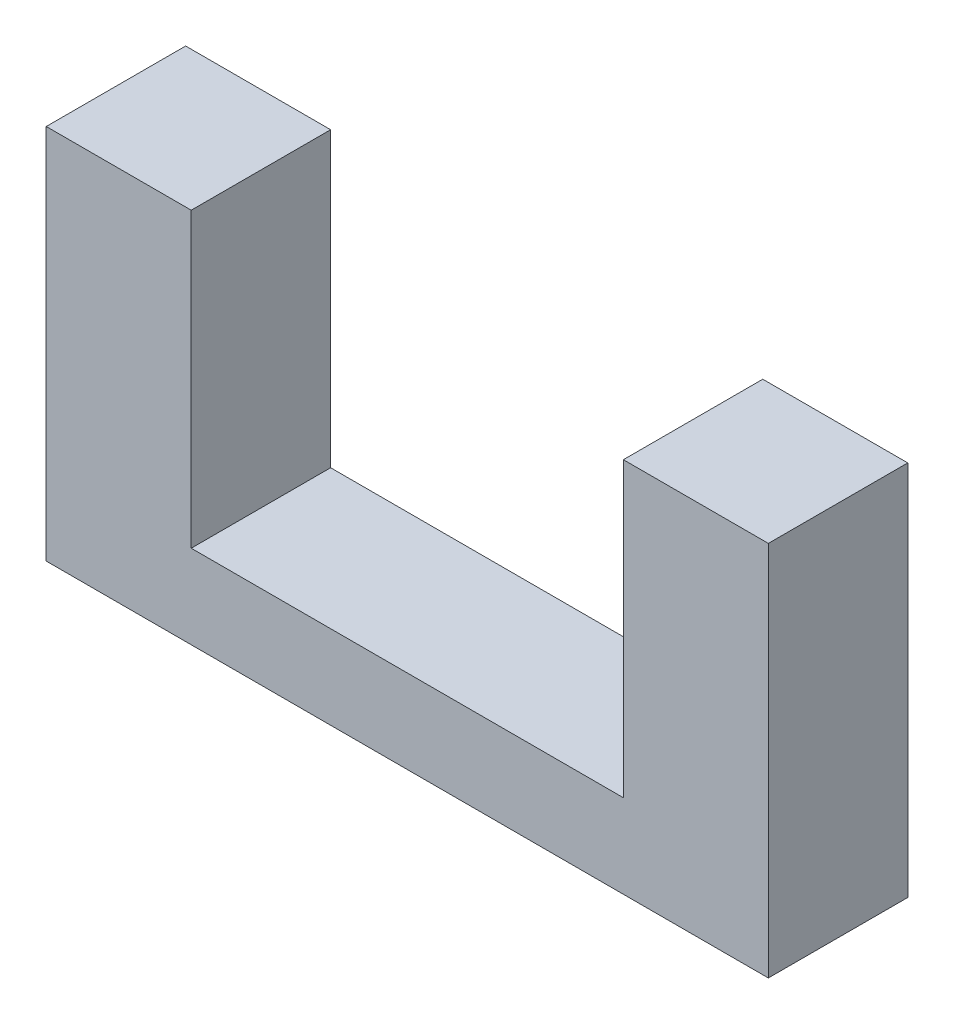
ISO-10303-21;
HEADER;
FILE_DESCRIPTION(('STEP AP214'),'2;1');
FILE_NAME('part.step','',(''),(''),'','','');
FILE_SCHEMA(('AUTOMOTIVE_DESIGN { 1 0 10303 214 1 1 1 1 }'));
ENDSEC;
DATA;
#1=APPLICATION_CONTEXT('core data for automotive mechanical design processes');
#2=APPLICATION_PROTOCOL_DEFINITION('international standard','automotive_design',2000,#1);
#3=PRODUCT_CONTEXT('',#1,'mechanical');
#4=PRODUCT('Part','Part','',(#3));
#5=PRODUCT_RELATED_PRODUCT_CATEGORY('part','',(#4));
#6=PRODUCT_DEFINITION_FORMATION('','',#4);
#7=PRODUCT_DEFINITION_CONTEXT('part definition',#1,'design');
#8=PRODUCT_DEFINITION('design','',#6,#7);
#9=PRODUCT_DEFINITION_SHAPE('','',#8);
#10=(LENGTH_UNIT() NAMED_UNIT(*) SI_UNIT(.MILLI.,.METRE.));
#11=(NAMED_UNIT(*) PLANE_ANGLE_UNIT() SI_UNIT($,.RADIAN.));
#12=(NAMED_UNIT(*) SI_UNIT($,.STERADIAN.) SOLID_ANGLE_UNIT());
#13=UNCERTAINTY_MEASURE_WITH_UNIT(LENGTH_MEASURE(1.E-05),#10,'distance_accuracy_value','');
#14=(GEOMETRIC_REPRESENTATION_CONTEXT(3) GLOBAL_UNCERTAINTY_ASSIGNED_CONTEXT((#13)) GLOBAL_UNIT_ASSIGNED_CONTEXT((#10,
#11,#12)) REPRESENTATION_CONTEXT('',''));
#15=CARTESIAN_POINT('',(0.,0.,0.));
#16=DIRECTION('',(0.,0.,1.));
#17=DIRECTION('',(1.,0.,0.));
#18=AXIS2_PLACEMENT_3D('',#15,#16,#17);
#19=CARTESIAN_POINT('',(15.5,13.5,10.));
#20=DIRECTION('',(0.,-1.,0.));
#21=DIRECTION('',(1.,0.,0.));
#22=AXIS2_PLACEMENT_3D('',#19,#20,#21);
#23=PLANE('',#22);
#24=DIRECTION('',(-1.,0.,0.));
#25=VECTOR('',#24,1.);
#26=CARTESIAN_POINT('',(15.5,13.5,0.));
#27=LINE('',#26,#25);
#28=CARTESIAN_POINT('',(25.9,13.5,0.));
#29=VERTEX_POINT('',#28);
#30=CARTESIAN_POINT('',(15.5,13.5,0.));
#31=VERTEX_POINT('',#30);
#32=EDGE_CURVE('E129',#29,#31,#27,.T.);
#33=ORIENTED_EDGE('',*,*,#32,.T.);
#34=DIRECTION('',(0.,0.,-1.));
#35=VECTOR('',#34,1.);
#36=CARTESIAN_POINT('',(15.5,13.5,10.));
#37=LINE('',#36,#35);
#38=CARTESIAN_POINT('',(15.5,13.5,10.));
#39=VERTEX_POINT('',#38);
#40=EDGE_CURVE('E11',#39,#31,#37,.T.);
#41=ORIENTED_EDGE('',*,*,#40,.F.);
#42=DIRECTION('',(-1.,0.,0.));
#43=VECTOR('',#42,1.);
#44=CARTESIAN_POINT('',(15.5,13.5,10.));
#45=LINE('',#44,#43);
#46=CARTESIAN_POINT('',(25.9,13.5,10.));
#47=VERTEX_POINT('',#46);
#48=EDGE_CURVE('E143',#47,#39,#45,.T.);
#49=ORIENTED_EDGE('',*,*,#48,.F.);
#50=DIRECTION('',(0.,0.,-1.));
#51=VECTOR('',#50,1.);
#52=CARTESIAN_POINT('',(25.9,13.5,10.));
#53=LINE('',#52,#51);
#54=EDGE_CURVE('E125',#47,#29,#53,.T.);
#55=ORIENTED_EDGE('',*,*,#54,.T.);
#56=EDGE_LOOP('',(#33,#41,#49,#55));
#57=FACE_BOUND('',#56,.T.);
#58=ADVANCED_FACE('F33',(#57),#23,.F.);
#59=CARTESIAN_POINT('',(15.5,-7.49999999999999,10.));
#60=DIRECTION('',(1.,0.,0.));
#61=DIRECTION('',(0.,1.,0.));
#62=AXIS2_PLACEMENT_3D('',#59,#60,#61);
#63=PLANE('',#62);
#64=DIRECTION('',(0.,-1.,0.));
#65=VECTOR('',#64,1.);
#66=CARTESIAN_POINT('',(15.5,-7.49999999999999,0.));
#67=LINE('',#66,#65);
#68=CARTESIAN_POINT('',(15.5,-7.49999999999999,0.));
#69=VERTEX_POINT('',#68);
#70=EDGE_CURVE('E132',#31,#69,#67,.T.);
#71=ORIENTED_EDGE('',*,*,#70,.T.);
#72=DIRECTION('',(0.,0.,-1.));
#73=VECTOR('',#72,1.);
#74=CARTESIAN_POINT('',(15.5,-7.49999999999999,10.));
#75=LINE('',#74,#73);
#76=CARTESIAN_POINT('',(15.5,-7.49999999999999,10.));
#77=VERTEX_POINT('',#76);
#78=EDGE_CURVE('E41',#77,#69,#75,.T.);
#79=ORIENTED_EDGE('',*,*,#78,.F.);
#80=DIRECTION('',(0.,-1.,0.));
#81=VECTOR('',#80,1.);
#82=CARTESIAN_POINT('',(15.5,-7.49999999999999,10.));
#83=LINE('',#82,#81);
#84=EDGE_CURVE('E92',#39,#77,#83,.T.);
#85=ORIENTED_EDGE('',*,*,#84,.F.);
#86=ORIENTED_EDGE('',*,*,#40,.T.);
#87=EDGE_LOOP('',(#71,#79,#85,#86));
#88=FACE_BOUND('',#87,.T.);
#89=ADVANCED_FACE('F178',(#88),#63,.F.);
#90=CARTESIAN_POINT('',(-15.5,-7.49999999999999,10.));
#91=DIRECTION('',(0.,-1.,0.));
#92=DIRECTION('',(0.,0.,-1.));
#93=AXIS2_PLACEMENT_3D('',#90,#91,#92);
#94=PLANE('',#93);
#95=DIRECTION('',(-1.,0.,0.));
#96=VECTOR('',#95,1.);
#97=CARTESIAN_POINT('',(-15.5,-7.49999999999999,0.));
#98=LINE('',#97,#96);
#99=CARTESIAN_POINT('',(-15.5,-7.49999999999999,0.));
#100=VERTEX_POINT('',#99);
#101=EDGE_CURVE('E134',#69,#100,#98,.T.);
#102=ORIENTED_EDGE('',*,*,#101,.T.);
#103=DIRECTION('',(0.,0.,-1.));
#104=VECTOR('',#103,1.);
#105=CARTESIAN_POINT('',(-15.5,-7.49999999999999,10.));
#106=LINE('',#105,#104);
#107=CARTESIAN_POINT('',(-15.5,-7.49999999999999,10.));
#108=VERTEX_POINT('',#107);
#109=EDGE_CURVE('E150',#108,#100,#106,.T.);
#110=ORIENTED_EDGE('',*,*,#109,.F.);
#111=DIRECTION('',(-1.,0.,0.));
#112=VECTOR('',#111,1.);
#113=CARTESIAN_POINT('',(-15.5,-7.49999999999999,10.));
#114=LINE('',#113,#112);
#115=EDGE_CURVE('E158',#77,#108,#114,.T.);
#116=ORIENTED_EDGE('',*,*,#115,.F.);
#117=ORIENTED_EDGE('',*,*,#78,.T.);
#118=EDGE_LOOP('',(#102,#110,#116,#117));
#119=FACE_BOUND('',#118,.T.);
#120=ADVANCED_FACE('F156',(#119),#94,.F.);
#121=CARTESIAN_POINT('',(-15.5,13.5,10.));
#122=DIRECTION('',(-1.,0.,0.));
#123=DIRECTION('',(0.,-1.,0.));
#124=AXIS2_PLACEMENT_3D('',#121,#122,#123);
#125=PLANE('',#124);
#126=DIRECTION('',(0.,1.,0.));
#127=VECTOR('',#126,1.);
#128=CARTESIAN_POINT('',(-15.5,13.5,0.));
#129=LINE('',#128,#127);
#130=CARTESIAN_POINT('',(-15.5,13.5,0.));
#131=VERTEX_POINT('',#130);
#132=EDGE_CURVE('E136',#100,#131,#129,.T.);
#133=ORIENTED_EDGE('',*,*,#132,.T.);
#134=DIRECTION('',(0.,0.,-1.));
#135=VECTOR('',#134,1.);
#136=CARTESIAN_POINT('',(-15.5,13.5,10.));
#137=LINE('',#136,#135);
#138=CARTESIAN_POINT('',(-15.5,13.5,10.));
#139=VERTEX_POINT('',#138);
#140=EDGE_CURVE('E147',#139,#131,#137,.T.);
#141=ORIENTED_EDGE('',*,*,#140,.F.);
#142=DIRECTION('',(0.,1.,0.));
#143=VECTOR('',#142,1.);
#144=CARTESIAN_POINT('',(-15.5,13.5,10.));
#145=LINE('',#144,#143);
#146=EDGE_CURVE('E170',#108,#139,#145,.T.);
#147=ORIENTED_EDGE('',*,*,#146,.F.);
#148=ORIENTED_EDGE('',*,*,#109,.T.);
#149=EDGE_LOOP('',(#133,#141,#147,#148));
#150=FACE_BOUND('',#149,.T.);
#151=ADVANCED_FACE('F166',(#150),#125,.F.);
#152=CARTESIAN_POINT('',(-25.9,13.5,10.));
#153=DIRECTION('',(0.,-1.,0.));
#154=DIRECTION('',(0.,0.,-1.));
#155=AXIS2_PLACEMENT_3D('',#152,#153,#154);
#156=PLANE('',#155);
#157=DIRECTION('',(-1.,0.,0.));
#158=VECTOR('',#157,1.);
#159=CARTESIAN_POINT('',(-25.9,13.5,0.));
#160=LINE('',#159,#158);
#161=CARTESIAN_POINT('',(-25.9,13.5,0.));
#162=VERTEX_POINT('',#161);
#163=EDGE_CURVE('E138',#131,#162,#160,.T.);
#164=ORIENTED_EDGE('',*,*,#163,.T.);
#165=DIRECTION('',(0.,0.,-1.));
#166=VECTOR('',#165,1.);
#167=CARTESIAN_POINT('',(-25.9,13.5,10.));
#168=LINE('',#167,#166);
#169=CARTESIAN_POINT('',(-25.9,13.5,10.));
#170=VERTEX_POINT('',#169);
#171=EDGE_CURVE('E120',#170,#162,#168,.T.);
#172=ORIENTED_EDGE('',*,*,#171,.F.);
#173=DIRECTION('',(-1.,0.,0.));
#174=VECTOR('',#173,1.);
#175=CARTESIAN_POINT('',(-25.9,13.5,10.));
#176=LINE('',#175,#174);
#177=EDGE_CURVE('E111',#139,#170,#176,.T.);
#178=ORIENTED_EDGE('',*,*,#177,.F.);
#179=ORIENTED_EDGE('',*,*,#140,.T.);
#180=EDGE_LOOP('',(#164,#172,#178,#179));
#181=FACE_BOUND('',#180,.T.);
#182=ADVANCED_FACE('F169',(#181),#156,.F.);
#183=CARTESIAN_POINT('',(-25.9,-13.5,10.));
#184=DIRECTION('',(1.,0.,0.));
#185=DIRECTION('',(0.,0.,-1.));
#186=AXIS2_PLACEMENT_3D('',#183,#184,#185);
#187=PLANE('',#186);
#188=DIRECTION('',(0.,-1.,0.));
#189=VECTOR('',#188,1.);
#190=CARTESIAN_POINT('',(-25.9,-13.5,0.));
#191=LINE('',#190,#189);
#192=CARTESIAN_POINT('',(-25.9,-13.5,0.));
#193=VERTEX_POINT('',#192);
#194=EDGE_CURVE('E119',#162,#193,#191,.T.);
#195=ORIENTED_EDGE('',*,*,#194,.T.);
#196=DIRECTION('',(0.,0.,-1.));
#197=VECTOR('',#196,1.);
#198=CARTESIAN_POINT('',(-25.9,-13.5,10.));
#199=LINE('',#198,#197);
#200=CARTESIAN_POINT('',(-25.9,-13.5,10.));
#201=VERTEX_POINT('',#200);
#202=EDGE_CURVE('E116',#201,#193,#199,.T.);
#203=ORIENTED_EDGE('',*,*,#202,.F.);
#204=DIRECTION('',(0.,-1.,0.));
#205=VECTOR('',#204,1.);
#206=CARTESIAN_POINT('',(-25.9,-13.5,10.));
#207=LINE('',#206,#205);
#208=EDGE_CURVE('E105',#170,#201,#207,.T.);
#209=ORIENTED_EDGE('',*,*,#208,.F.);
#210=ORIENTED_EDGE('',*,*,#171,.T.);
#211=EDGE_LOOP('',(#195,#203,#209,#210));
#212=FACE_BOUND('',#211,.T.);
#213=ADVANCED_FACE('F117',(#212),#187,.F.);
#214=CARTESIAN_POINT('',(-25.9,-13.5,10.));
#215=DIRECTION('',(0.,1.,0.));
#216=DIRECTION('',(-1.,0.,0.));
#217=AXIS2_PLACEMENT_3D('',#214,#215,#216);
#218=PLANE('',#217);
#219=DIRECTION('',(1.,0.,0.));
#220=VECTOR('',#219,1.);
#221=CARTESIAN_POINT('',(-25.9,-13.5,0.));
#222=LINE('',#221,#220);
#223=CARTESIAN_POINT('',(25.9,-13.5,0.));
#224=VERTEX_POINT('',#223);
#225=EDGE_CURVE('E78',#193,#224,#222,.T.);
#226=ORIENTED_EDGE('',*,*,#225,.T.);
#227=DIRECTION('',(0.,0.,-1.));
#228=VECTOR('',#227,1.);
#229=CARTESIAN_POINT('',(25.9,-13.5,10.));
#230=LINE('',#229,#228);
#231=CARTESIAN_POINT('',(25.9,-13.5,10.));
#232=VERTEX_POINT('',#231);
#233=EDGE_CURVE('E121',#232,#224,#230,.T.);
#234=ORIENTED_EDGE('',*,*,#233,.F.);
#235=DIRECTION('',(1.,0.,0.));
#236=VECTOR('',#235,1.);
#237=CARTESIAN_POINT('',(-25.9,-13.5,10.));
#238=LINE('',#237,#236);
#239=EDGE_CURVE('E109',#201,#232,#238,.T.);
#240=ORIENTED_EDGE('',*,*,#239,.F.);
#241=ORIENTED_EDGE('',*,*,#202,.T.);
#242=EDGE_LOOP('',(#226,#234,#240,#241));
#243=FACE_BOUND('',#242,.T.);
#244=ADVANCED_FACE('F123',(#243),#218,.F.);
#245=CARTESIAN_POINT('',(25.9,-13.5,10.));
#246=DIRECTION('',(-1.,0.,0.));
#247=DIRECTION('',(0.,0.,1.));
#248=AXIS2_PLACEMENT_3D('',#245,#246,#247);
#249=PLANE('',#248);
#250=DIRECTION('',(0.,1.,0.));
#251=VECTOR('',#250,1.);
#252=CARTESIAN_POINT('',(25.9,-13.5,0.));
#253=LINE('',#252,#251);
#254=EDGE_CURVE('E84',#224,#29,#253,.T.);
#255=ORIENTED_EDGE('',*,*,#254,.T.);
#256=ORIENTED_EDGE('',*,*,#54,.F.);
#257=DIRECTION('',(0.,1.,0.));
#258=VECTOR('',#257,1.);
#259=CARTESIAN_POINT('',(25.9,-13.5,10.));
#260=LINE('',#259,#258);
#261=EDGE_CURVE('E49',#232,#47,#260,.T.);
#262=ORIENTED_EDGE('',*,*,#261,.F.);
#263=ORIENTED_EDGE('',*,*,#233,.T.);
#264=EDGE_LOOP('',(#255,#256,#262,#263));
#265=FACE_BOUND('',#264,.T.);
#266=ADVANCED_FACE('F194',(#265),#249,.F.);
#267=CARTESIAN_POINT('',(0.,0.,10.));
#268=DIRECTION('',(0.,0.,1.));
#269=DIRECTION('',(1.,0.,0.));
#270=AXIS2_PLACEMENT_3D('',#267,#268,#269);
#271=PLANE('',#270);
#272=ORIENTED_EDGE('',*,*,#48,.T.);
#273=ORIENTED_EDGE('',*,*,#84,.T.);
#274=ORIENTED_EDGE('',*,*,#115,.T.);
#275=ORIENTED_EDGE('',*,*,#146,.T.);
#276=ORIENTED_EDGE('',*,*,#177,.T.);
#277=ORIENTED_EDGE('',*,*,#208,.T.);
#278=ORIENTED_EDGE('',*,*,#239,.T.);
#279=ORIENTED_EDGE('',*,*,#261,.T.);
#280=EDGE_LOOP('',(#272,#273,#274,#275,#276,#277,#278,#279));
#281=FACE_BOUND('',#280,.T.);
#282=ADVANCED_FACE('F107',(#281),#271,.T.);
#283=CARTESIAN_POINT('',(0.,0.,0.));
#284=DIRECTION('',(0.,0.,1.));
#285=DIRECTION('',(1.,0.,0.));
#286=AXIS2_PLACEMENT_3D('',#283,#284,#285);
#287=PLANE('',#286);
#288=ORIENTED_EDGE('',*,*,#32,.F.);
#289=ORIENTED_EDGE('',*,*,#254,.F.);
#290=ORIENTED_EDGE('',*,*,#225,.F.);
#291=ORIENTED_EDGE('',*,*,#194,.F.);
#292=ORIENTED_EDGE('',*,*,#163,.F.);
#293=ORIENTED_EDGE('',*,*,#132,.F.);
#294=ORIENTED_EDGE('',*,*,#101,.F.);
#295=ORIENTED_EDGE('',*,*,#70,.F.);
#296=EDGE_LOOP('',(#288,#289,#290,#291,#292,#293,#294,#295));
#297=FACE_BOUND('',#296,.T.);
#298=ADVANCED_FACE('F162',(#297),#287,.F.);
#299=CLOSED_SHELL('',(#58,#89,#120,#151,#182,#213,#244,#266,#282,#298));
#300=MANIFOLD_SOLID_BREP('B2',#299);
#301=ADVANCED_BREP_SHAPE_REPRESENTATION('',(#18,#300),#14);
#302=SHAPE_DEFINITION_REPRESENTATION(#9,#301);
ENDSEC;
END-ISO-10303-21;
